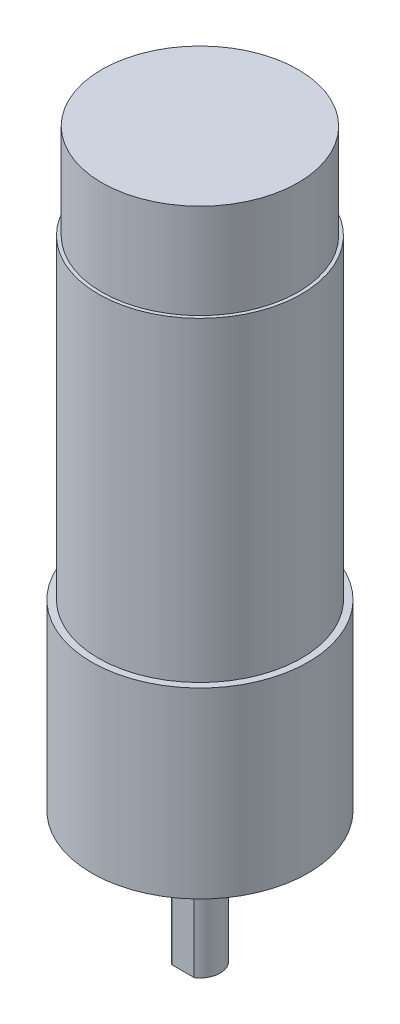
ISO-10303-21;
HEADER;
FILE_DESCRIPTION(('STEP AP214'),'2;1');
FILE_NAME('part.step','',(''),(''),'','','');
FILE_SCHEMA(('AUTOMOTIVE_DESIGN { 1 0 10303 214 1 1 1 1 }'));
ENDSEC;
DATA;
#1=APPLICATION_CONTEXT('core data for automotive mechanical design processes');
#2=APPLICATION_PROTOCOL_DEFINITION('international standard','automotive_design',2000,#1);
#3=PRODUCT_CONTEXT('',#1,'mechanical');
#4=PRODUCT('Part','Part','',(#3));
#5=PRODUCT_RELATED_PRODUCT_CATEGORY('part','',(#4));
#6=PRODUCT_DEFINITION_FORMATION('','',#4);
#7=PRODUCT_DEFINITION_CONTEXT('part definition',#1,'design');
#8=PRODUCT_DEFINITION('design','',#6,#7);
#9=PRODUCT_DEFINITION_SHAPE('','',#8);
#10=(LENGTH_UNIT() NAMED_UNIT(*) SI_UNIT(.MILLI.,.METRE.));
#11=(NAMED_UNIT(*) PLANE_ANGLE_UNIT() SI_UNIT($,.RADIAN.));
#12=(NAMED_UNIT(*) SI_UNIT($,.STERADIAN.) SOLID_ANGLE_UNIT());
#13=UNCERTAINTY_MEASURE_WITH_UNIT(LENGTH_MEASURE(1.E-05),#10,'distance_accuracy_value','');
#14=(GEOMETRIC_REPRESENTATION_CONTEXT(3) GLOBAL_UNCERTAINTY_ASSIGNED_CONTEXT((#13)) GLOBAL_UNIT_ASSIGNED_CONTEXT((#10,
#11,#12)) REPRESENTATION_CONTEXT('',''));
#15=CARTESIAN_POINT('',(0.,0.,0.));
#16=DIRECTION('',(0.,0.,1.));
#17=DIRECTION('',(1.,0.,0.));
#18=AXIS2_PLACEMENT_3D('',#15,#16,#17);
#19=CARTESIAN_POINT('',(0.,73.6,0.));
#20=DIRECTION('',(0.,1.,0.));
#21=DIRECTION('',(0.,0.,1.));
#22=AXIS2_PLACEMENT_3D('',#19,#20,#21);
#23=PLANE('',#22);
#24=CARTESIAN_POINT('',(0.,73.6,0.));
#25=DIRECTION('',(0.,1.,0.));
#26=DIRECTION('',(0.,0.,1.));
#27=AXIS2_PLACEMENT_3D('',#24,#25,#26);
#28=CIRCLE('',#27,15.);
#29=CARTESIAN_POINT('',(0.,73.6,15.));
#30=VERTEX_POINT('',#29);
#31=EDGE_CURVE('E89',#30,#30,#28,.T.);
#32=ORIENTED_EDGE('',*,*,#31,.T.);
#33=EDGE_LOOP('',(#32));
#34=FACE_BOUND('',#33,.T.);
#35=CARTESIAN_POINT('',(0.,73.6,0.));
#36=DIRECTION('',(0.,1.,0.));
#37=DIRECTION('',(0.,0.,1.));
#38=AXIS2_PLACEMENT_3D('',#35,#36,#37);
#39=CIRCLE('',#38,14.5);
#40=CARTESIAN_POINT('',(0.,73.6,14.5));
#41=VERTEX_POINT('',#40);
#42=EDGE_CURVE('E325',#41,#41,#39,.T.);
#43=ORIENTED_EDGE('',*,*,#42,.F.);
#44=EDGE_LOOP('',(#43));
#45=FACE_BOUND('',#44,.T.);
#46=ADVANCED_FACE('F29',(#34,#45),#23,.T.);
#47=CARTESIAN_POINT('',(0.,27.,0.));
#48=DIRECTION('',(0.,1.,0.));
#49=DIRECTION('',(0.,0.,1.));
#50=AXIS2_PLACEMENT_3D('',#47,#48,#49);
#51=PLANE('',#50);
#52=CARTESIAN_POINT('',(0.,27.,0.));
#53=DIRECTION('',(0.,1.,0.));
#54=DIRECTION('',(0.,0.,1.));
#55=AXIS2_PLACEMENT_3D('',#52,#53,#54);
#56=CIRCLE('',#55,16.);
#57=CARTESIAN_POINT('',(0.,27.,16.));
#58=VERTEX_POINT('',#57);
#59=EDGE_CURVE('E37',#58,#58,#56,.T.);
#60=ORIENTED_EDGE('',*,*,#59,.T.);
#61=EDGE_LOOP('',(#60));
#62=FACE_BOUND('',#61,.T.);
#63=CARTESIAN_POINT('',(0.,27.,0.));
#64=DIRECTION('',(0.,1.,0.));
#65=DIRECTION('',(0.,0.,1.));
#66=AXIS2_PLACEMENT_3D('',#63,#64,#65);
#67=CIRCLE('',#66,15.);
#68=CARTESIAN_POINT('',(0.,27.,15.));
#69=VERTEX_POINT('',#68);
#70=EDGE_CURVE('E353',#69,#69,#67,.T.);
#71=ORIENTED_EDGE('',*,*,#70,.F.);
#72=EDGE_LOOP('',(#71));
#73=FACE_BOUND('',#72,.T.);
#74=ADVANCED_FACE('F136',(#62,#73),#51,.T.);
#75=CARTESIAN_POINT('',(0.,-3.,0.));
#76=DIRECTION('',(0.,1.,0.));
#77=DIRECTION('',(0.,0.,1.));
#78=AXIS2_PLACEMENT_3D('',#75,#76,#77);
#79=PLANE('',#78);
#80=CARTESIAN_POINT('',(0.,-3.,0.));
#81=DIRECTION('',(0.,-1.,0.));
#82=DIRECTION('',(0.,0.,1.));
#83=AXIS2_PLACEMENT_3D('',#80,#81,#82);
#84=CIRCLE('',#83,10.);
#85=CARTESIAN_POINT('',(9.,-3.,4.35889894354067));
#86=VERTEX_POINT('',#85);
#87=CARTESIAN_POINT('',(-9.,-3.,4.35889894354068));
#88=VERTEX_POINT('',#87);
#89=EDGE_CURVE('E111',#86,#88,#84,.T.);
#90=ORIENTED_EDGE('',*,*,#89,.T.);
#91=DIRECTION('',(0.,0.,-1.));
#92=VECTOR('',#91,1.);
#93=CARTESIAN_POINT('',(-9.,-3.,4.35889894354068));
#94=LINE('',#93,#92);
#95=CARTESIAN_POINT('',(-9.,-3.,-4.35889894354068));
#96=VERTEX_POINT('',#95);
#97=EDGE_CURVE('E114',#88,#96,#94,.T.);
#98=ORIENTED_EDGE('',*,*,#97,.T.);
#99=CARTESIAN_POINT('',(0.,-3.,0.));
#100=DIRECTION('',(0.,-1.,0.));
#101=DIRECTION('',(0.,0.,1.));
#102=AXIS2_PLACEMENT_3D('',#99,#100,#101);
#103=CIRCLE('',#102,9.99999999999999);
#104=CARTESIAN_POINT('',(9.,-3.,-4.35889894354067));
#105=VERTEX_POINT('',#104);
#106=EDGE_CURVE('E116',#96,#105,#103,.T.);
#107=ORIENTED_EDGE('',*,*,#106,.T.);
#108=DIRECTION('',(0.,0.,1.));
#109=VECTOR('',#108,1.);
#110=CARTESIAN_POINT('',(9.,-3.,4.35889894354067));
#111=LINE('',#110,#109);
#112=EDGE_CURVE('E118',#105,#86,#111,.T.);
#113=ORIENTED_EDGE('',*,*,#112,.T.);
#114=EDGE_LOOP('',(#90,#98,#107,#113));
#115=FACE_BOUND('',#114,.T.);
#116=CARTESIAN_POINT('',(0.,-3.,0.));
#117=DIRECTION('',(0.,1.,0.));
#118=DIRECTION('',(0.,0.,1.));
#119=AXIS2_PLACEMENT_3D('',#116,#117,#118);
#120=CIRCLE('',#119,3.);
#121=CARTESIAN_POINT('',(0.,-3.,3.));
#122=VERTEX_POINT('',#121);
#123=EDGE_CURVE('E11',#122,#122,#120,.F.);
#124=ORIENTED_EDGE('',*,*,#123,.F.);
#125=EDGE_LOOP('',(#124));
#126=FACE_BOUND('',#125,.T.);
#127=ADVANCED_FACE('F146',(#115,#126),#79,.F.);
#128=CARTESIAN_POINT('',(0.,0.,0.));
#129=DIRECTION('',(0.,1.,0.));
#130=DIRECTION('',(0.,0.,1.));
#131=AXIS2_PLACEMENT_3D('',#128,#129,#130);
#132=PLANE('',#131);
#133=CARTESIAN_POINT('',(-9.1923881554251,0.,-9.19238815542513));
#134=DIRECTION('',(0.,-1.,0.));
#135=DIRECTION('',(0.,0.,-1.));
#136=AXIS2_PLACEMENT_3D('',#133,#134,#135);
#137=CIRCLE('',#136,1.5);
#138=CARTESIAN_POINT('',(-9.1923881554251,0.,-10.6923881554251));
#139=VERTEX_POINT('',#138);
#140=EDGE_CURVE('E324',#139,#139,#137,.T.);
#141=ORIENTED_EDGE('',*,*,#140,.F.);
#142=EDGE_LOOP('',(#141));
#143=FACE_BOUND('',#142,.T.);
#144=CARTESIAN_POINT('',(9.1923881554251,0.,-9.19238815542513));
#145=DIRECTION('',(0.,-1.,0.));
#146=DIRECTION('',(0.,0.,1.));
#147=AXIS2_PLACEMENT_3D('',#144,#145,#146);
#148=CIRCLE('',#147,1.5);
#149=CARTESIAN_POINT('',(9.1923881554251,0.,-7.69238815542513));
#150=VERTEX_POINT('',#149);
#151=EDGE_CURVE('E335',#150,#150,#148,.T.);
#152=ORIENTED_EDGE('',*,*,#151,.F.);
#153=EDGE_LOOP('',(#152));
#154=FACE_BOUND('',#153,.T.);
#155=CARTESIAN_POINT('',(-9.1923881554251,0.,9.19238815542513));
#156=DIRECTION('',(0.,-1.,0.));
#157=DIRECTION('',(0.,0.,1.));
#158=AXIS2_PLACEMENT_3D('',#155,#156,#157);
#159=CIRCLE('',#158,1.5);
#160=CARTESIAN_POINT('',(-9.1923881554251,0.,10.6923881554251));
#161=VERTEX_POINT('',#160);
#162=EDGE_CURVE('E341',#161,#161,#159,.T.);
#163=ORIENTED_EDGE('',*,*,#162,.F.);
#164=EDGE_LOOP('',(#163));
#165=FACE_BOUND('',#164,.T.);
#166=CARTESIAN_POINT('',(9.1923881554251,0.,9.19238815542513));
#167=DIRECTION('',(0.,-1.,0.));
#168=DIRECTION('',(0.,0.,-1.));
#169=AXIS2_PLACEMENT_3D('',#166,#167,#168);
#170=CIRCLE('',#169,1.5);
#171=CARTESIAN_POINT('',(9.1923881554251,0.,7.69238815542513));
#172=VERTEX_POINT('',#171);
#173=EDGE_CURVE('E347',#172,#172,#170,.T.);
#174=ORIENTED_EDGE('',*,*,#173,.F.);
#175=EDGE_LOOP('',(#174));
#176=FACE_BOUND('',#175,.T.);
#177=CARTESIAN_POINT('',(0.,0.,0.));
#178=DIRECTION('',(0.,1.,0.));
#179=DIRECTION('',(0.,0.,1.));
#180=AXIS2_PLACEMENT_3D('',#177,#178,#179);
#181=CIRCLE('',#180,16.);
#182=CARTESIAN_POINT('',(0.,0.,16.));
#183=VERTEX_POINT('',#182);
#184=EDGE_CURVE('E131',#183,#183,#181,.T.);
#185=ORIENTED_EDGE('',*,*,#184,.F.);
#186=EDGE_LOOP('',(#185));
#187=FACE_BOUND('',#186,.T.);
#188=CARTESIAN_POINT('',(0.,0.,0.));
#189=DIRECTION('',(0.,-1.,0.));
#190=DIRECTION('',(0.,0.,1.));
#191=AXIS2_PLACEMENT_3D('',#188,#189,#190);
#192=CIRCLE('',#191,10.);
#193=CARTESIAN_POINT('',(9.,0.,4.35889894354067));
#194=VERTEX_POINT('',#193);
#195=CARTESIAN_POINT('',(-9.,0.,4.35889894354068));
#196=VERTEX_POINT('',#195);
#197=EDGE_CURVE('E98',#194,#196,#192,.T.);
#198=ORIENTED_EDGE('',*,*,#197,.F.);
#199=DIRECTION('',(0.,0.,1.));
#200=VECTOR('',#199,1.);
#201=CARTESIAN_POINT('',(9.,0.,4.35889894354067));
#202=LINE('',#201,#200);
#203=CARTESIAN_POINT('',(9.,0.,-4.35889894354067));
#204=VERTEX_POINT('',#203);
#205=EDGE_CURVE('E108',#204,#194,#202,.T.);
#206=ORIENTED_EDGE('',*,*,#205,.F.);
#207=CARTESIAN_POINT('',(0.,0.,0.));
#208=DIRECTION('',(0.,-1.,0.));
#209=DIRECTION('',(0.,0.,1.));
#210=AXIS2_PLACEMENT_3D('',#207,#208,#209);
#211=CIRCLE('',#210,9.99999999999999);
#212=CARTESIAN_POINT('',(-9.,0.,-4.35889894354068));
#213=VERTEX_POINT('',#212);
#214=EDGE_CURVE('E105',#213,#204,#211,.T.);
#215=ORIENTED_EDGE('',*,*,#214,.F.);
#216=DIRECTION('',(0.,0.,-1.));
#217=VECTOR('',#216,1.);
#218=CARTESIAN_POINT('',(-9.,0.,4.35889894354068));
#219=LINE('',#218,#217);
#220=EDGE_CURVE('E52',#196,#213,#219,.T.);
#221=ORIENTED_EDGE('',*,*,#220,.F.);
#222=EDGE_LOOP('',(#198,#206,#215,#221));
#223=FACE_BOUND('',#222,.T.);
#224=ADVANCED_FACE('F142',(#143,#154,#165,#176,#187,#223),#132,.F.);
#225=CARTESIAN_POINT('',(0.,27.,0.));
#226=DIRECTION('',(0.,-1.,0.));
#227=DIRECTION('',(0.,0.,-1.));
#228=AXIS2_PLACEMENT_3D('',#225,#226,#227);
#229=CYLINDRICAL_SURFACE('',#228,16.);
#230=ORIENTED_EDGE('',*,*,#59,.F.);
#231=EDGE_LOOP('',(#230));
#232=FACE_BOUND('',#231,.T.);
#233=ORIENTED_EDGE('',*,*,#184,.T.);
#234=EDGE_LOOP('',(#233));
#235=FACE_BOUND('',#234,.T.);
#236=ADVANCED_FACE('F31',(#232,#235),#229,.T.);
#237=CARTESIAN_POINT('',(0.,-3.,0.));
#238=DIRECTION('',(0.,1.,0.));
#239=DIRECTION('',(0.,0.,1.));
#240=AXIS2_PLACEMENT_3D('',#237,#238,#239);
#241=CYLINDRICAL_SURFACE('',#240,10.);
#242=ORIENTED_EDGE('',*,*,#197,.T.);
#243=DIRECTION('',(0.,1.,0.));
#244=VECTOR('',#243,1.);
#245=CARTESIAN_POINT('',(-9.,-3.,4.35889894354068));
#246=LINE('',#245,#244);
#247=EDGE_CURVE('E129',#88,#196,#246,.T.);
#248=ORIENTED_EDGE('',*,*,#247,.F.);
#249=ORIENTED_EDGE('',*,*,#89,.F.);
#250=DIRECTION('',(0.,1.,0.));
#251=VECTOR('',#250,1.);
#252=CARTESIAN_POINT('',(9.,-3.,4.35889894354067));
#253=LINE('',#252,#251);
#254=EDGE_CURVE('E120',#86,#194,#253,.T.);
#255=ORIENTED_EDGE('',*,*,#254,.T.);
#256=EDGE_LOOP('',(#242,#248,#249,#255));
#257=FACE_BOUND('',#256,.T.);
#258=ADVANCED_FACE('F141',(#257),#241,.T.);
#259=CARTESIAN_POINT('',(-9.,-3.,4.35889894354068));
#260=DIRECTION('',(1.,0.,0.));
#261=DIRECTION('',(0.,0.,-1.));
#262=AXIS2_PLACEMENT_3D('',#259,#260,#261);
#263=PLANE('',#262);
#264=ORIENTED_EDGE('',*,*,#220,.T.);
#265=DIRECTION('',(0.,1.,0.));
#266=VECTOR('',#265,1.);
#267=CARTESIAN_POINT('',(-9.,-3.,-4.35889894354068));
#268=LINE('',#267,#266);
#269=EDGE_CURVE('E126',#96,#213,#268,.T.);
#270=ORIENTED_EDGE('',*,*,#269,.F.);
#271=ORIENTED_EDGE('',*,*,#97,.F.);
#272=ORIENTED_EDGE('',*,*,#247,.T.);
#273=EDGE_LOOP('',(#264,#270,#271,#272));
#274=FACE_BOUND('',#273,.T.);
#275=ADVANCED_FACE('F164',(#274),#263,.F.);
#276=CARTESIAN_POINT('',(0.,-3.,0.));
#277=DIRECTION('',(0.,1.,0.));
#278=DIRECTION('',(0.,0.,1.));
#279=AXIS2_PLACEMENT_3D('',#276,#277,#278);
#280=CYLINDRICAL_SURFACE('',#279,9.99999999999999);
#281=ORIENTED_EDGE('',*,*,#214,.T.);
#282=DIRECTION('',(0.,1.,0.));
#283=VECTOR('',#282,1.);
#284=CARTESIAN_POINT('',(9.,-3.,-4.35889894354067));
#285=LINE('',#284,#283);
#286=EDGE_CURVE('E123',#105,#204,#285,.T.);
#287=ORIENTED_EDGE('',*,*,#286,.F.);
#288=ORIENTED_EDGE('',*,*,#106,.F.);
#289=ORIENTED_EDGE('',*,*,#269,.T.);
#290=EDGE_LOOP('',(#281,#287,#288,#289));
#291=FACE_BOUND('',#290,.T.);
#292=ADVANCED_FACE('F162',(#291),#280,.T.);
#293=CARTESIAN_POINT('',(9.,-3.,4.35889894354067));
#294=DIRECTION('',(-1.,0.,0.));
#295=DIRECTION('',(0.,0.,1.));
#296=AXIS2_PLACEMENT_3D('',#293,#294,#295);
#297=PLANE('',#296);
#298=ORIENTED_EDGE('',*,*,#205,.T.);
#299=ORIENTED_EDGE('',*,*,#254,.F.);
#300=ORIENTED_EDGE('',*,*,#112,.F.);
#301=ORIENTED_EDGE('',*,*,#286,.T.);
#302=EDGE_LOOP('',(#298,#299,#300,#301));
#303=FACE_BOUND('',#302,.T.);
#304=ADVANCED_FACE('F153',(#303),#297,.F.);
#305=CARTESIAN_POINT('',(0.,-19.3,0.));
#306=DIRECTION('',(0.,1.,0.));
#307=DIRECTION('',(0.,0.,1.));
#308=AXIS2_PLACEMENT_3D('',#305,#306,#307);
#309=CYLINDRICAL_SURFACE('',#308,3.);
#310=CARTESIAN_POINT('',(0.,-19.3,0.));
#311=DIRECTION('',(0.,-1.,0.));
#312=DIRECTION('',(0.,0.,-1.));
#313=AXIS2_PLACEMENT_3D('',#310,#311,#312);
#314=CIRCLE('',#313,3.);
#315=CARTESIAN_POINT('',(-1.6583123951777,-19.3,2.5));
#316=VERTEX_POINT('',#315);
#317=CARTESIAN_POINT('',(1.6583123951777,-19.3,2.5));
#318=VERTEX_POINT('',#317);
#319=EDGE_CURVE('E95',#316,#318,#314,.T.);
#320=ORIENTED_EDGE('',*,*,#319,.F.);
#321=DIRECTION('',(0.,-1.,0.));
#322=VECTOR('',#321,1.);
#323=CARTESIAN_POINT('',(-1.6583123951777,-7.3,2.5));
#324=LINE('',#323,#322);
#325=CARTESIAN_POINT('',(-1.6583123951777,-7.3,2.5));
#326=VERTEX_POINT('',#325);
#327=EDGE_CURVE('E44',#326,#316,#324,.T.);
#328=ORIENTED_EDGE('',*,*,#327,.F.);
#329=CARTESIAN_POINT('',(0.,-7.3,0.));
#330=DIRECTION('',(0.,-1.,0.));
#331=DIRECTION('',(0.,0.,-1.));
#332=AXIS2_PLACEMENT_3D('',#329,#330,#331);
#333=CIRCLE('',#332,3.);
#334=CARTESIAN_POINT('',(1.6583123951777,-7.3,2.5));
#335=VERTEX_POINT('',#334);
#336=EDGE_CURVE('E88',#335,#326,#333,.T.);
#337=ORIENTED_EDGE('',*,*,#336,.F.);
#338=DIRECTION('',(0.,-1.,0.));
#339=VECTOR('',#338,1.);
#340=CARTESIAN_POINT('',(1.6583123951777,-7.3,2.5));
#341=LINE('',#340,#339);
#342=EDGE_CURVE('E83',#335,#318,#341,.T.);
#343=ORIENTED_EDGE('',*,*,#342,.T.);
#344=EDGE_LOOP('',(#320,#328,#337,#343));
#345=FACE_BOUND('',#344,.T.);
#346=ORIENTED_EDGE('',*,*,#123,.T.);
#347=EDGE_LOOP('',(#346));
#348=FACE_BOUND('',#347,.T.);
#349=ADVANCED_FACE('F93',(#345,#348),#309,.T.);
#350=CARTESIAN_POINT('',(0.,-19.3,0.));
#351=DIRECTION('',(0.,-1.,0.));
#352=DIRECTION('',(0.,0.,-1.));
#353=AXIS2_PLACEMENT_3D('',#350,#351,#352);
#354=PLANE('',#353);
#355=DIRECTION('',(1.,0.,0.));
#356=VECTOR('',#355,1.);
#357=CARTESIAN_POINT('',(0.,-19.3,2.5));
#358=LINE('',#357,#356);
#359=EDGE_CURVE('E80',#316,#318,#358,.T.);
#360=ORIENTED_EDGE('',*,*,#359,.F.);
#361=ORIENTED_EDGE('',*,*,#319,.T.);
#362=EDGE_LOOP('',(#360,#361));
#363=FACE_BOUND('',#362,.T.);
#364=ADVANCED_FACE('F97',(#363),#354,.T.);
#365=CARTESIAN_POINT('',(0.,-7.3,2.5));
#366=DIRECTION('',(0.,0.,-1.));
#367=DIRECTION('',(-1.,0.,0.));
#368=AXIS2_PLACEMENT_3D('',#365,#366,#367);
#369=PLANE('',#368);
#370=ORIENTED_EDGE('',*,*,#359,.T.);
#371=ORIENTED_EDGE('',*,*,#342,.F.);
#372=DIRECTION('',(1.,0.,0.));
#373=VECTOR('',#372,1.);
#374=CARTESIAN_POINT('',(0.,-7.3,2.5));
#375=LINE('',#374,#373);
#376=EDGE_CURVE('E358',#326,#335,#375,.T.);
#377=ORIENTED_EDGE('',*,*,#376,.F.);
#378=ORIENTED_EDGE('',*,*,#327,.T.);
#379=EDGE_LOOP('',(#370,#371,#377,#378));
#380=FACE_BOUND('',#379,.T.);
#381=ADVANCED_FACE('F82',(#380),#369,.F.);
#382=CARTESIAN_POINT('',(0.,-7.3,-6.74142135623731));
#383=DIRECTION('',(0.,-1.,0.));
#384=DIRECTION('',(0.,0.,-1.));
#385=AXIS2_PLACEMENT_3D('',#382,#383,#384);
#386=PLANE('',#385);
#387=ORIENTED_EDGE('',*,*,#336,.T.);
#388=ORIENTED_EDGE('',*,*,#376,.T.);
#389=EDGE_LOOP('',(#387,#388));
#390=FACE_BOUND('',#389,.T.);
#391=ADVANCED_FACE('F190',(#390),#386,.T.);
#392=CARTESIAN_POINT('',(0.,73.6,0.));
#393=DIRECTION('',(0.,-1.,0.));
#394=DIRECTION('',(0.,0.,-1.));
#395=AXIS2_PLACEMENT_3D('',#392,#393,#394);
#396=CYLINDRICAL_SURFACE('',#395,15.);
#397=ORIENTED_EDGE('',*,*,#31,.F.);
#398=EDGE_LOOP('',(#397));
#399=FACE_BOUND('',#398,.T.);
#400=ORIENTED_EDGE('',*,*,#70,.T.);
#401=EDGE_LOOP('',(#400));
#402=FACE_BOUND('',#401,.T.);
#403=ADVANCED_FACE('F187',(#399,#402),#396,.T.);
#404=CARTESIAN_POINT('',(9.1923881554251,5.5,9.19238815542513));
#405=DIRECTION('',(0.,-1.,0.));
#406=DIRECTION('',(0.,0.,-1.));
#407=AXIS2_PLACEMENT_3D('',#404,#405,#406);
#408=CYLINDRICAL_SURFACE('',#407,1.5);
#409=CARTESIAN_POINT('',(9.1923881554251,5.5,9.19238815542513));
#410=DIRECTION('',(0.,-1.,0.));
#411=DIRECTION('',(0.,0.,-1.));
#412=AXIS2_PLACEMENT_3D('',#409,#410,#411);
#413=CIRCLE('',#412,1.5);
#414=CARTESIAN_POINT('',(9.1923881554251,5.5,7.69238815542513));
#415=VERTEX_POINT('',#414);
#416=EDGE_CURVE('E350',#415,#415,#413,.T.);
#417=ORIENTED_EDGE('',*,*,#416,.F.);
#418=EDGE_LOOP('',(#417));
#419=FACE_BOUND('',#418,.T.);
#420=ORIENTED_EDGE('',*,*,#173,.T.);
#421=EDGE_LOOP('',(#420));
#422=FACE_BOUND('',#421,.T.);
#423=ADVANCED_FACE('F185',(#419,#422),#408,.F.);
#424=CARTESIAN_POINT('',(9.1923881554251,5.5,9.19238815542513));
#425=DIRECTION('',(0.,-1.,0.));
#426=DIRECTION('',(0.,0.,-1.));
#427=AXIS2_PLACEMENT_3D('',#424,#425,#426);
#428=PLANE('',#427);
#429=ORIENTED_EDGE('',*,*,#416,.T.);
#430=EDGE_LOOP('',(#429));
#431=FACE_BOUND('',#430,.T.);
#432=ADVANCED_FACE('F248',(#431),#428,.T.);
#433=CARTESIAN_POINT('',(-9.1923881554251,5.5,9.19238815542513));
#434=DIRECTION('',(0.,-1.,0.));
#435=DIRECTION('',(0.,0.,-1.));
#436=AXIS2_PLACEMENT_3D('',#433,#434,#435);
#437=CYLINDRICAL_SURFACE('',#436,1.5);
#438=CARTESIAN_POINT('',(-9.1923881554251,5.5,9.19238815542513));
#439=DIRECTION('',(0.,-1.,0.));
#440=DIRECTION('',(0.,0.,1.));
#441=AXIS2_PLACEMENT_3D('',#438,#439,#440);
#442=CIRCLE('',#441,1.5);
#443=CARTESIAN_POINT('',(-9.1923881554251,5.5,10.6923881554251));
#444=VERTEX_POINT('',#443);
#445=EDGE_CURVE('E344',#444,#444,#442,.T.);
#446=ORIENTED_EDGE('',*,*,#445,.F.);
#447=EDGE_LOOP('',(#446));
#448=FACE_BOUND('',#447,.T.);
#449=ORIENTED_EDGE('',*,*,#162,.T.);
#450=EDGE_LOOP('',(#449));
#451=FACE_BOUND('',#450,.T.);
#452=ADVANCED_FACE('F255',(#448,#451),#437,.F.);
#453=CARTESIAN_POINT('',(-9.1923881554251,5.5,9.19238815542513));
#454=DIRECTION('',(0.,1.,0.));
#455=DIRECTION('',(0.,0.,1.));
#456=AXIS2_PLACEMENT_3D('',#453,#454,#455);
#457=PLANE('',#456);
#458=ORIENTED_EDGE('',*,*,#445,.T.);
#459=EDGE_LOOP('',(#458));
#460=FACE_BOUND('',#459,.T.);
#461=ADVANCED_FACE('F262',(#460),#457,.F.);
#462=CARTESIAN_POINT('',(9.1923881554251,5.5,-9.19238815542513));
#463=DIRECTION('',(0.,-1.,0.));
#464=DIRECTION('',(0.,0.,-1.));
#465=AXIS2_PLACEMENT_3D('',#462,#463,#464);
#466=CYLINDRICAL_SURFACE('',#465,1.5);
#467=CARTESIAN_POINT('',(9.1923881554251,5.5,-9.19238815542513));
#468=DIRECTION('',(0.,-1.,0.));
#469=DIRECTION('',(0.,0.,1.));
#470=AXIS2_PLACEMENT_3D('',#467,#468,#469);
#471=CIRCLE('',#470,1.5);
#472=CARTESIAN_POINT('',(9.1923881554251,5.5,-7.69238815542513));
#473=VERTEX_POINT('',#472);
#474=EDGE_CURVE('E338',#473,#473,#471,.T.);
#475=ORIENTED_EDGE('',*,*,#474,.F.);
#476=EDGE_LOOP('',(#475));
#477=FACE_BOUND('',#476,.T.);
#478=ORIENTED_EDGE('',*,*,#151,.T.);
#479=EDGE_LOOP('',(#478));
#480=FACE_BOUND('',#479,.T.);
#481=ADVANCED_FACE('F270',(#477,#480),#466,.F.);
#482=CARTESIAN_POINT('',(9.1923881554251,5.5,-9.19238815542513));
#483=DIRECTION('',(0.,1.,0.));
#484=DIRECTION('',(0.,0.,1.));
#485=AXIS2_PLACEMENT_3D('',#482,#483,#484);
#486=PLANE('',#485);
#487=ORIENTED_EDGE('',*,*,#474,.T.);
#488=EDGE_LOOP('',(#487));
#489=FACE_BOUND('',#488,.T.);
#490=ADVANCED_FACE('F278',(#489),#486,.F.);
#491=CARTESIAN_POINT('',(-9.1923881554251,5.5,-9.19238815542513));
#492=DIRECTION('',(0.,-1.,0.));
#493=DIRECTION('',(0.,0.,-1.));
#494=AXIS2_PLACEMENT_3D('',#491,#492,#493);
#495=CYLINDRICAL_SURFACE('',#494,1.5);
#496=CARTESIAN_POINT('',(-9.1923881554251,5.5,-9.19238815542513));
#497=DIRECTION('',(0.,-1.,0.));
#498=DIRECTION('',(0.,0.,-1.));
#499=AXIS2_PLACEMENT_3D('',#496,#497,#498);
#500=CIRCLE('',#499,1.5);
#501=CARTESIAN_POINT('',(-9.1923881554251,5.5,-10.6923881554251));
#502=VERTEX_POINT('',#501);
#503=EDGE_CURVE('E328',#502,#502,#500,.T.);
#504=ORIENTED_EDGE('',*,*,#503,.F.);
#505=EDGE_LOOP('',(#504));
#506=FACE_BOUND('',#505,.T.);
#507=ORIENTED_EDGE('',*,*,#140,.T.);
#508=EDGE_LOOP('',(#507));
#509=FACE_BOUND('',#508,.T.);
#510=ADVANCED_FACE('F286',(#506,#509),#495,.F.);
#511=CARTESIAN_POINT('',(-9.1923881554251,5.5,-9.19238815542513));
#512=DIRECTION('',(0.,-1.,0.));
#513=DIRECTION('',(0.,0.,-1.));
#514=AXIS2_PLACEMENT_3D('',#511,#512,#513);
#515=PLANE('',#514);
#516=ORIENTED_EDGE('',*,*,#503,.T.);
#517=EDGE_LOOP('',(#516));
#518=FACE_BOUND('',#517,.T.);
#519=ADVANCED_FACE('F293',(#518),#515,.T.);
#520=CARTESIAN_POINT('',(0.,87.6,0.));
#521=DIRECTION('',(0.,-1.,0.));
#522=DIRECTION('',(0.,0.,-1.));
#523=AXIS2_PLACEMENT_3D('',#520,#521,#522);
#524=CYLINDRICAL_SURFACE('',#523,14.5);
#525=CARTESIAN_POINT('',(0.,87.6,0.));
#526=DIRECTION('',(0.,1.,0.));
#527=DIRECTION('',(0.,0.,1.));
#528=AXIS2_PLACEMENT_3D('',#525,#526,#527);
#529=CIRCLE('',#528,14.5);
#530=CARTESIAN_POINT('',(0.,87.6,14.5));
#531=VERTEX_POINT('',#530);
#532=EDGE_CURVE('E323',#531,#531,#529,.T.);
#533=ORIENTED_EDGE('',*,*,#532,.F.);
#534=EDGE_LOOP('',(#533));
#535=FACE_BOUND('',#534,.T.);
#536=ORIENTED_EDGE('',*,*,#42,.T.);
#537=EDGE_LOOP('',(#536));
#538=FACE_BOUND('',#537,.T.);
#539=ADVANCED_FACE('F300',(#535,#538),#524,.T.);
#540=CARTESIAN_POINT('',(0.,87.6,0.));
#541=DIRECTION('',(0.,1.,0.));
#542=DIRECTION('',(0.,0.,1.));
#543=AXIS2_PLACEMENT_3D('',#540,#541,#542);
#544=PLANE('',#543);
#545=ORIENTED_EDGE('',*,*,#532,.T.);
#546=EDGE_LOOP('',(#545));
#547=FACE_BOUND('',#546,.T.);
#548=ADVANCED_FACE('F311',(#547),#544,.T.);
#549=CLOSED_SHELL('',(#46,#74,#127,#224,#236,#258,#275,#292,#304,#349,#364,#381,#391,#403,#423,
#432,#452,#461,#481,#490,#510,#519,#539,#548));
#550=MANIFOLD_SOLID_BREP('B2',#549);
#551=ADVANCED_BREP_SHAPE_REPRESENTATION('',(#18,#550),#14);
#552=SHAPE_DEFINITION_REPRESENTATION(#9,#551);
ENDSEC;
END-ISO-10303-21;
